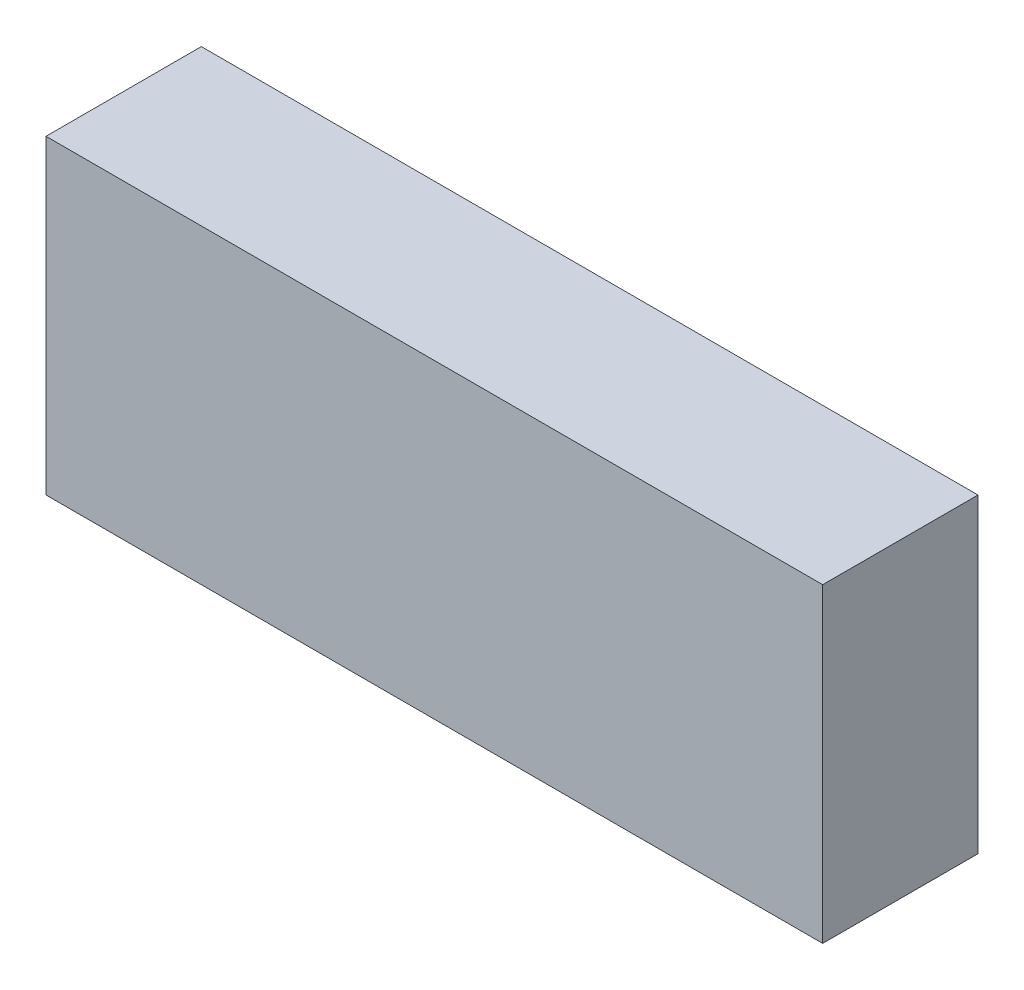
ISO-10303-21;
HEADER;
FILE_DESCRIPTION(('STEP AP214'),'2;1');
FILE_NAME('part.step','',(''),(''),'','','');
FILE_SCHEMA(('AUTOMOTIVE_DESIGN { 1 0 10303 214 1 1 1 1 }'));
ENDSEC;
DATA;
#1=APPLICATION_CONTEXT('core data for automotive mechanical design processes');
#2=APPLICATION_PROTOCOL_DEFINITION('international standard','automotive_design',2000,#1);
#3=PRODUCT_CONTEXT('',#1,'mechanical');
#4=PRODUCT('Part','Part','',(#3));
#5=PRODUCT_RELATED_PRODUCT_CATEGORY('part','',(#4));
#6=PRODUCT_DEFINITION_FORMATION('','',#4);
#7=PRODUCT_DEFINITION_CONTEXT('part definition',#1,'design');
#8=PRODUCT_DEFINITION('design','',#6,#7);
#9=PRODUCT_DEFINITION_SHAPE('','',#8);
#10=(LENGTH_UNIT() NAMED_UNIT(*) SI_UNIT(.MILLI.,.METRE.));
#11=(NAMED_UNIT(*) PLANE_ANGLE_UNIT() SI_UNIT($,.RADIAN.));
#12=(NAMED_UNIT(*) SI_UNIT($,.STERADIAN.) SOLID_ANGLE_UNIT());
#13=UNCERTAINTY_MEASURE_WITH_UNIT(LENGTH_MEASURE(1.E-05),#10,'distance_accuracy_value','');
#14=(GEOMETRIC_REPRESENTATION_CONTEXT(3) GLOBAL_UNCERTAINTY_ASSIGNED_CONTEXT((#13)) GLOBAL_UNIT_ASSIGNED_CONTEXT((#10,
#11,#12)) REPRESENTATION_CONTEXT('',''));
#15=CARTESIAN_POINT('',(0.,0.,0.));
#16=DIRECTION('',(0.,0.,1.));
#17=DIRECTION('',(1.,0.,0.));
#18=AXIS2_PLACEMENT_3D('',#15,#16,#17);
#19=CARTESIAN_POINT('',(0.,0.,9.));
#20=DIRECTION('',(1.,0.,0.));
#21=DIRECTION('',(0.,0.,-1.));
#22=AXIS2_PLACEMENT_3D('',#19,#20,#21);
#23=PLANE('',#22);
#24=DIRECTION('',(0.,-1.,0.));
#25=VECTOR('',#24,1.);
#26=CARTESIAN_POINT('',(0.,0.,0.));
#27=LINE('',#26,#25);
#28=CARTESIAN_POINT('',(0.,18.,0.));
#29=VERTEX_POINT('',#28);
#30=CARTESIAN_POINT('',(0.,0.,0.));
#31=VERTEX_POINT('',#30);
#32=EDGE_CURVE('E96',#29,#31,#27,.T.);
#33=ORIENTED_EDGE('',*,*,#32,.T.);
#34=DIRECTION('',(0.,0.,-1.));
#35=VECTOR('',#34,1.);
#36=CARTESIAN_POINT('',(0.,0.,9.));
#37=LINE('',#36,#35);
#38=CARTESIAN_POINT('',(0.,0.,9.));
#39=VERTEX_POINT('',#38);
#40=EDGE_CURVE('E11',#39,#31,#37,.T.);
#41=ORIENTED_EDGE('',*,*,#40,.F.);
#42=DIRECTION('',(0.,-1.,0.));
#43=VECTOR('',#42,1.);
#44=CARTESIAN_POINT('',(0.,0.,9.));
#45=LINE('',#44,#43);
#46=CARTESIAN_POINT('',(0.,18.,9.));
#47=VERTEX_POINT('',#46);
#48=EDGE_CURVE('E84',#47,#39,#45,.T.);
#49=ORIENTED_EDGE('',*,*,#48,.F.);
#50=DIRECTION('',(0.,0.,-1.));
#51=VECTOR('',#50,1.);
#52=CARTESIAN_POINT('',(0.,18.,9.));
#53=LINE('',#52,#51);
#54=EDGE_CURVE('E92',#47,#29,#53,.T.);
#55=ORIENTED_EDGE('',*,*,#54,.T.);
#56=EDGE_LOOP('',(#33,#41,#49,#55));
#57=FACE_BOUND('',#56,.T.);
#58=ADVANCED_FACE('F33',(#57),#23,.F.);
#59=CARTESIAN_POINT('',(0.,0.,9.));
#60=DIRECTION('',(0.,1.,0.));
#61=DIRECTION('',(0.,0.,1.));
#62=AXIS2_PLACEMENT_3D('',#59,#60,#61);
#63=PLANE('',#62);
#64=DIRECTION('',(1.,0.,0.));
#65=VECTOR('',#64,1.);
#66=CARTESIAN_POINT('',(0.,0.,0.));
#67=LINE('',#66,#65);
#68=CARTESIAN_POINT('',(45.,0.,0.));
#69=VERTEX_POINT('',#68);
#70=EDGE_CURVE('E88',#31,#69,#67,.T.);
#71=ORIENTED_EDGE('',*,*,#70,.T.);
#72=DIRECTION('',(0.,0.,-1.));
#73=VECTOR('',#72,1.);
#74=CARTESIAN_POINT('',(45.,0.,9.));
#75=LINE('',#74,#73);
#76=CARTESIAN_POINT('',(45.,0.,9.));
#77=VERTEX_POINT('',#76);
#78=EDGE_CURVE('E41',#77,#69,#75,.T.);
#79=ORIENTED_EDGE('',*,*,#78,.F.);
#80=DIRECTION('',(1.,0.,0.));
#81=VECTOR('',#80,1.);
#82=CARTESIAN_POINT('',(0.,0.,9.));
#83=LINE('',#82,#81);
#84=EDGE_CURVE('E79',#39,#77,#83,.T.);
#85=ORIENTED_EDGE('',*,*,#84,.F.);
#86=ORIENTED_EDGE('',*,*,#40,.T.);
#87=EDGE_LOOP('',(#71,#79,#85,#86));
#88=FACE_BOUND('',#87,.T.);
#89=ADVANCED_FACE('F87',(#88),#63,.F.);
#90=CARTESIAN_POINT('',(45.,0.,9.));
#91=DIRECTION('',(-1.,0.,0.));
#92=DIRECTION('',(0.,0.,1.));
#93=AXIS2_PLACEMENT_3D('',#90,#91,#92);
#94=PLANE('',#93);
#95=DIRECTION('',(0.,1.,0.));
#96=VECTOR('',#95,1.);
#97=CARTESIAN_POINT('',(45.,0.,0.));
#98=LINE('',#97,#96);
#99=CARTESIAN_POINT('',(45.,18.,0.));
#100=VERTEX_POINT('',#99);
#101=EDGE_CURVE('E66',#69,#100,#98,.T.);
#102=ORIENTED_EDGE('',*,*,#101,.T.);
#103=DIRECTION('',(0.,0.,-1.));
#104=VECTOR('',#103,1.);
#105=CARTESIAN_POINT('',(45.,18.,9.));
#106=LINE('',#105,#104);
#107=CARTESIAN_POINT('',(45.,18.,9.));
#108=VERTEX_POINT('',#107);
#109=EDGE_CURVE('E89',#108,#100,#106,.T.);
#110=ORIENTED_EDGE('',*,*,#109,.F.);
#111=DIRECTION('',(0.,1.,0.));
#112=VECTOR('',#111,1.);
#113=CARTESIAN_POINT('',(45.,0.,9.));
#114=LINE('',#113,#112);
#115=EDGE_CURVE('E82',#77,#108,#114,.T.);
#116=ORIENTED_EDGE('',*,*,#115,.F.);
#117=ORIENTED_EDGE('',*,*,#78,.T.);
#118=EDGE_LOOP('',(#102,#110,#116,#117));
#119=FACE_BOUND('',#118,.T.);
#120=ADVANCED_FACE('F90',(#119),#94,.F.);
#121=CARTESIAN_POINT('',(0.,18.,9.));
#122=DIRECTION('',(0.,-1.,0.));
#123=DIRECTION('',(0.,0.,-1.));
#124=AXIS2_PLACEMENT_3D('',#121,#122,#123);
#125=PLANE('',#124);
#126=DIRECTION('',(-1.,0.,0.));
#127=VECTOR('',#126,1.);
#128=CARTESIAN_POINT('',(0.,18.,0.));
#129=LINE('',#128,#127);
#130=EDGE_CURVE('E72',#100,#29,#129,.T.);
#131=ORIENTED_EDGE('',*,*,#130,.T.);
#132=ORIENTED_EDGE('',*,*,#54,.F.);
#133=DIRECTION('',(-1.,0.,0.));
#134=VECTOR('',#133,1.);
#135=CARTESIAN_POINT('',(0.,18.,9.));
#136=LINE('',#135,#134);
#137=EDGE_CURVE('E49',#108,#47,#136,.T.);
#138=ORIENTED_EDGE('',*,*,#137,.F.);
#139=ORIENTED_EDGE('',*,*,#109,.T.);
#140=EDGE_LOOP('',(#131,#132,#138,#139));
#141=FACE_BOUND('',#140,.T.);
#142=ADVANCED_FACE('F103',(#141),#125,.F.);
#143=CARTESIAN_POINT('',(0.,18.,9.));
#144=DIRECTION('',(0.,0.,-1.));
#145=DIRECTION('',(-1.,0.,0.));
#146=AXIS2_PLACEMENT_3D('',#143,#144,#145);
#147=PLANE('',#146);
#148=ORIENTED_EDGE('',*,*,#48,.T.);
#149=ORIENTED_EDGE('',*,*,#84,.T.);
#150=ORIENTED_EDGE('',*,*,#115,.T.);
#151=ORIENTED_EDGE('',*,*,#137,.T.);
#152=EDGE_LOOP('',(#148,#149,#150,#151));
#153=FACE_BOUND('',#152,.T.);
#154=ADVANCED_FACE('F80',(#153),#147,.F.);
#155=CARTESIAN_POINT('',(0.,18.,0.));
#156=DIRECTION('',(0.,0.,-1.));
#157=DIRECTION('',(-1.,0.,0.));
#158=AXIS2_PLACEMENT_3D('',#155,#156,#157);
#159=PLANE('',#158);
#160=ORIENTED_EDGE('',*,*,#32,.F.);
#161=ORIENTED_EDGE('',*,*,#130,.F.);
#162=ORIENTED_EDGE('',*,*,#101,.F.);
#163=ORIENTED_EDGE('',*,*,#70,.F.);
#164=EDGE_LOOP('',(#160,#161,#162,#163));
#165=FACE_BOUND('',#164,.T.);
#166=ADVANCED_FACE('F106',(#165),#159,.T.);
#167=CLOSED_SHELL('',(#58,#89,#120,#142,#154,#166));
#168=MANIFOLD_SOLID_BREP('B2',#167);
#169=ADVANCED_BREP_SHAPE_REPRESENTATION('',(#18,#168),#14);
#170=SHAPE_DEFINITION_REPRESENTATION(#9,#169);
ENDSEC;
END-ISO-10303-21;
